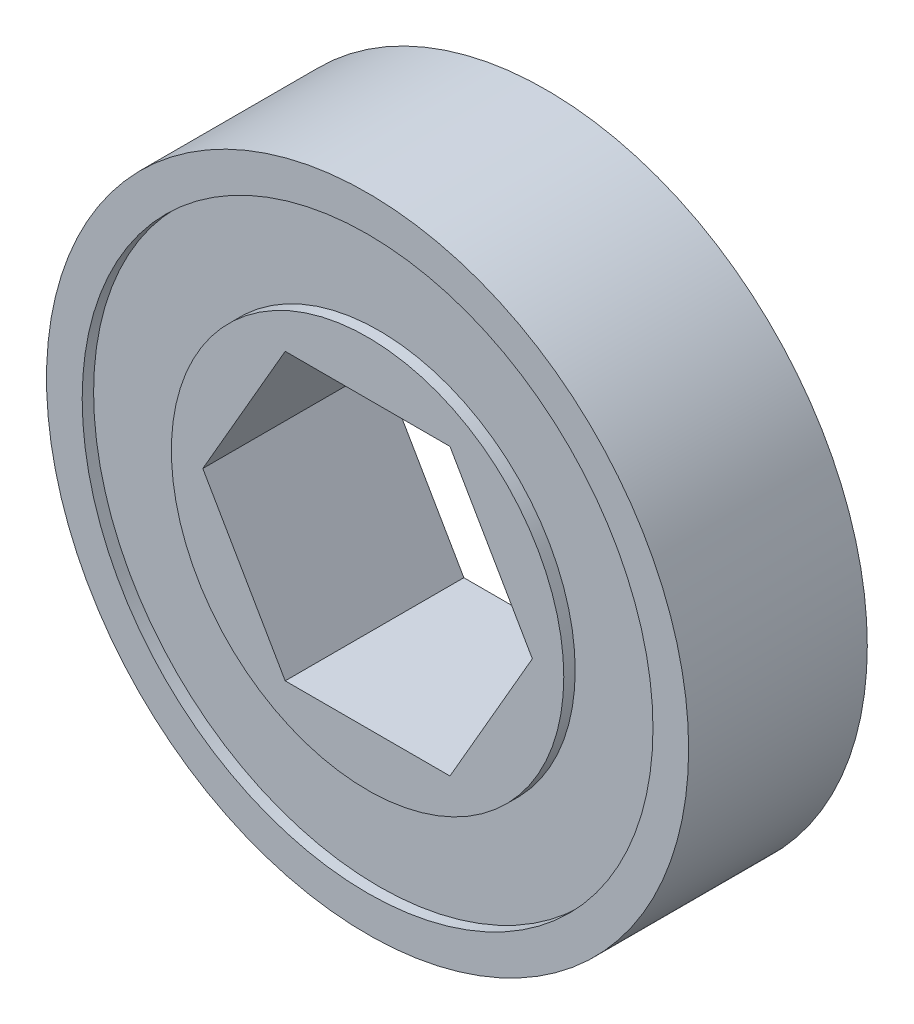
ISO-10303-21;
HEADER;
FILE_DESCRIPTION(('STEP AP214'),'2;1');
FILE_NAME('part.step','',(''),(''),'','','');
FILE_SCHEMA(('AUTOMOTIVE_DESIGN { 1 0 10303 214 1 1 1 1 }'));
ENDSEC;
DATA;
#1=APPLICATION_CONTEXT('core data for automotive mechanical design processes');
#2=APPLICATION_PROTOCOL_DEFINITION('international standard','automotive_design',2000,#1);
#3=PRODUCT_CONTEXT('',#1,'mechanical');
#4=PRODUCT('Part','Part','',(#3));
#5=PRODUCT_RELATED_PRODUCT_CATEGORY('part','',(#4));
#6=PRODUCT_DEFINITION_FORMATION('','',#4);
#7=PRODUCT_DEFINITION_CONTEXT('part definition',#1,'design');
#8=PRODUCT_DEFINITION('design','',#6,#7);
#9=PRODUCT_DEFINITION_SHAPE('','',#8);
#10=(LENGTH_UNIT() NAMED_UNIT(*) SI_UNIT(.MILLI.,.METRE.));
#11=(NAMED_UNIT(*) PLANE_ANGLE_UNIT() SI_UNIT($,.RADIAN.));
#12=(NAMED_UNIT(*) SI_UNIT($,.STERADIAN.) SOLID_ANGLE_UNIT());
#13=UNCERTAINTY_MEASURE_WITH_UNIT(LENGTH_MEASURE(1.E-05),#10,'distance_accuracy_value','');
#14=(GEOMETRIC_REPRESENTATION_CONTEXT(3) GLOBAL_UNCERTAINTY_ASSIGNED_CONTEXT((#13)) GLOBAL_UNIT_ASSIGNED_CONTEXT((#10,
#11,#12)) REPRESENTATION_CONTEXT('',''));
#15=CARTESIAN_POINT('',(0.,0.,0.));
#16=DIRECTION('',(0.,0.,1.));
#17=DIRECTION('',(1.,0.,0.));
#18=AXIS2_PLACEMENT_3D('',#15,#16,#17);
#19=CARTESIAN_POINT('',(0.,0.,-3.9751));
#20=DIRECTION('',(0.,0.,1.));
#21=DIRECTION('',(1.,0.,0.));
#22=AXIS2_PLACEMENT_3D('',#19,#20,#21);
#23=PLANE('',#22);
#24=DIRECTION('',(0.5,0.866025403784439,0.));
#25=VECTOR('',#24,1.);
#26=CARTESIAN_POINT('',(3.66617420935412,-6.35,-3.9751));
#27=LINE('',#26,#25);
#28=CARTESIAN_POINT('',(3.66617420935412,-6.35,-3.9751));
#29=VERTEX_POINT('',#28);
#30=CARTESIAN_POINT('',(7.33234841870825,0.,-3.9751));
#31=VERTEX_POINT('',#30);
#32=EDGE_CURVE('E58',#29,#31,#27,.T.);
#33=ORIENTED_EDGE('',*,*,#32,.T.);
#34=DIRECTION('',(-0.5,0.866025403784438,0.));
#35=VECTOR('',#34,1.);
#36=CARTESIAN_POINT('',(7.33234841870825,0.,-3.9751));
#37=LINE('',#36,#35);
#38=CARTESIAN_POINT('',(3.66617420935412,6.35,-3.9751));
#39=VERTEX_POINT('',#38);
#40=EDGE_CURVE('E103',#31,#39,#37,.T.);
#41=ORIENTED_EDGE('',*,*,#40,.T.);
#42=DIRECTION('',(-1.,0.,0.));
#43=VECTOR('',#42,1.);
#44=CARTESIAN_POINT('',(3.66617420935412,6.35,-3.9751));
#45=LINE('',#44,#43);
#46=CARTESIAN_POINT('',(-3.66617420935412,6.35,-3.9751));
#47=VERTEX_POINT('',#46);
#48=EDGE_CURVE('E124',#39,#47,#45,.T.);
#49=ORIENTED_EDGE('',*,*,#48,.T.);
#50=DIRECTION('',(-0.5,-0.866025403784439,0.));
#51=VECTOR('',#50,1.);
#52=CARTESIAN_POINT('',(-3.66617420935412,6.35,-3.9751));
#53=LINE('',#52,#51);
#54=CARTESIAN_POINT('',(-7.33234841870825,0.,-3.9751));
#55=VERTEX_POINT('',#54);
#56=EDGE_CURVE('E127',#47,#55,#53,.T.);
#57=ORIENTED_EDGE('',*,*,#56,.T.);
#58=DIRECTION('',(0.5,-0.866025403784439,0.));
#59=VECTOR('',#58,1.);
#60=CARTESIAN_POINT('',(-7.33234841870825,0.,-3.9751));
#61=LINE('',#60,#59);
#62=CARTESIAN_POINT('',(-3.66617420935412,-6.35,-3.9751));
#63=VERTEX_POINT('',#62);
#64=EDGE_CURVE('E130',#55,#63,#61,.T.);
#65=ORIENTED_EDGE('',*,*,#64,.T.);
#66=DIRECTION('',(1.,0.,0.));
#67=VECTOR('',#66,1.);
#68=CARTESIAN_POINT('',(-3.66617420935412,-6.35,-3.9751));
#69=LINE('',#68,#67);
#70=EDGE_CURVE('E97',#63,#29,#69,.T.);
#71=ORIENTED_EDGE('',*,*,#70,.T.);
#72=EDGE_LOOP('',(#33,#41,#49,#57,#65,#71));
#73=FACE_BOUND('',#72,.T.);
#74=CARTESIAN_POINT('',(0.,0.,-3.9751));
#75=DIRECTION('',(0.,0.,1.));
#76=DIRECTION('',(1.,0.,0.));
#77=AXIS2_PLACEMENT_3D('',#74,#75,#76);
#78=CIRCLE('',#77,8.73125);
#79=CARTESIAN_POINT('',(8.73125,0.,-3.9751));
#80=VERTEX_POINT('',#79);
#81=EDGE_CURVE('E194',#80,#80,#78,.T.);
#82=ORIENTED_EDGE('',*,*,#81,.F.);
#83=EDGE_LOOP('',(#82));
#84=FACE_BOUND('',#83,.T.);
#85=ADVANCED_FACE('F35',(#73,#84),#23,.F.);
#86=CARTESIAN_POINT('',(0.,0.,3.9751));
#87=DIRECTION('',(0.,0.,1.));
#88=DIRECTION('',(1.,0.,0.));
#89=AXIS2_PLACEMENT_3D('',#86,#87,#88);
#90=PLANE('',#89);
#91=DIRECTION('',(-0.5,0.866025403784438,0.));
#92=VECTOR('',#91,1.);
#93=CARTESIAN_POINT('',(7.33234841870825,0.,3.9751));
#94=LINE('',#93,#92);
#95=CARTESIAN_POINT('',(7.33234841870825,0.,3.9751));
#96=VERTEX_POINT('',#95);
#97=CARTESIAN_POINT('',(3.66617420935412,6.35,3.9751));
#98=VERTEX_POINT('',#97);
#99=EDGE_CURVE('E96',#96,#98,#94,.T.);
#100=ORIENTED_EDGE('',*,*,#99,.F.);
#101=DIRECTION('',(0.5,0.866025403784439,0.));
#102=VECTOR('',#101,1.);
#103=CARTESIAN_POINT('',(3.66617420935412,-6.35,3.9751));
#104=LINE('',#103,#102);
#105=CARTESIAN_POINT('',(3.66617420935412,-6.35,3.9751));
#106=VERTEX_POINT('',#105);
#107=EDGE_CURVE('E88',#106,#96,#104,.T.);
#108=ORIENTED_EDGE('',*,*,#107,.F.);
#109=DIRECTION('',(1.,0.,0.));
#110=VECTOR('',#109,1.);
#111=CARTESIAN_POINT('',(-3.66617420935412,-6.35,3.9751));
#112=LINE('',#111,#110);
#113=CARTESIAN_POINT('',(-3.66617420935412,-6.35,3.9751));
#114=VERTEX_POINT('',#113);
#115=EDGE_CURVE('E119',#114,#106,#112,.T.);
#116=ORIENTED_EDGE('',*,*,#115,.F.);
#117=DIRECTION('',(0.5,-0.866025403784439,0.));
#118=VECTOR('',#117,1.);
#119=CARTESIAN_POINT('',(-7.33234841870825,0.,3.9751));
#120=LINE('',#119,#118);
#121=CARTESIAN_POINT('',(-7.33234841870825,0.,3.9751));
#122=VERTEX_POINT('',#121);
#123=EDGE_CURVE('E117',#122,#114,#120,.T.);
#124=ORIENTED_EDGE('',*,*,#123,.F.);
#125=DIRECTION('',(-0.5,-0.866025403784439,0.));
#126=VECTOR('',#125,1.);
#127=CARTESIAN_POINT('',(-3.66617420935412,6.35,3.9751));
#128=LINE('',#127,#126);
#129=CARTESIAN_POINT('',(-3.66617420935412,6.35,3.9751));
#130=VERTEX_POINT('',#129);
#131=EDGE_CURVE('E112',#130,#122,#128,.T.);
#132=ORIENTED_EDGE('',*,*,#131,.F.);
#133=DIRECTION('',(-1.,0.,0.));
#134=VECTOR('',#133,1.);
#135=CARTESIAN_POINT('',(3.66617420935412,6.35,3.9751));
#136=LINE('',#135,#134);
#137=EDGE_CURVE('E110',#98,#130,#136,.T.);
#138=ORIENTED_EDGE('',*,*,#137,.F.);
#139=EDGE_LOOP('',(#100,#108,#116,#124,#132,#138));
#140=FACE_BOUND('',#139,.T.);
#141=CARTESIAN_POINT('',(0.,0.,3.9751));
#142=DIRECTION('',(0.,0.,1.));
#143=DIRECTION('',(1.,0.,0.));
#144=AXIS2_PLACEMENT_3D('',#141,#142,#143);
#145=CIRCLE('',#144,8.73125);
#146=CARTESIAN_POINT('',(8.73125,0.,3.9751));
#147=VERTEX_POINT('',#146);
#148=EDGE_CURVE('E191',#147,#147,#145,.T.);
#149=ORIENTED_EDGE('',*,*,#148,.T.);
#150=EDGE_LOOP('',(#149));
#151=FACE_BOUND('',#150,.T.);
#152=ADVANCED_FACE('F107',(#140,#151),#90,.T.);
#153=CARTESIAN_POINT('',(0.,0.,3.9751));
#154=DIRECTION('',(0.,0.,1.));
#155=DIRECTION('',(1.,0.,0.));
#156=AXIS2_PLACEMENT_3D('',#153,#154,#155);
#157=CIRCLE('',#156,12.7);
#158=CARTESIAN_POINT('',(12.7,0.,3.9751));
#159=VERTEX_POINT('',#158);
#160=EDGE_CURVE('E201',#159,#159,#157,.T.);
#161=ORIENTED_EDGE('',*,*,#160,.F.);
#162=EDGE_LOOP('',(#161));
#163=FACE_BOUND('',#162,.T.);
#164=CARTESIAN_POINT('',(0.,0.,3.9751));
#165=DIRECTION('',(0.,0.,1.));
#166=DIRECTION('',(1.,0.,0.));
#167=AXIS2_PLACEMENT_3D('',#164,#165,#166);
#168=CIRCLE('',#167,14.2875);
#169=CARTESIAN_POINT('',(14.2875,0.,3.9751));
#170=VERTEX_POINT('',#169);
#171=EDGE_CURVE('E11',#170,#170,#168,.T.);
#172=ORIENTED_EDGE('',*,*,#171,.T.);
#173=EDGE_LOOP('',(#172));
#174=FACE_BOUND('',#173,.T.);
#175=ADVANCED_FACE('F169',(#163,#174),#90,.T.);
#176=CARTESIAN_POINT('',(0.,0.,-3.9751));
#177=DIRECTION('',(0.,0.,1.));
#178=DIRECTION('',(1.,0.,0.));
#179=AXIS2_PLACEMENT_3D('',#176,#177,#178);
#180=CIRCLE('',#179,12.7);
#181=CARTESIAN_POINT('',(12.7,0.,-3.9751));
#182=VERTEX_POINT('',#181);
#183=EDGE_CURVE('E182',#182,#182,#180,.T.);
#184=ORIENTED_EDGE('',*,*,#183,.T.);
#185=EDGE_LOOP('',(#184));
#186=FACE_BOUND('',#185,.T.);
#187=CARTESIAN_POINT('',(0.,0.,-3.9751));
#188=DIRECTION('',(0.,0.,1.));
#189=DIRECTION('',(1.,0.,0.));
#190=AXIS2_PLACEMENT_3D('',#187,#188,#189);
#191=CIRCLE('',#190,14.2875);
#192=CARTESIAN_POINT('',(14.2875,0.,-3.9751));
#193=VERTEX_POINT('',#192);
#194=EDGE_CURVE('E39',#193,#193,#191,.T.);
#195=ORIENTED_EDGE('',*,*,#194,.F.);
#196=EDGE_LOOP('',(#195));
#197=FACE_BOUND('',#196,.T.);
#198=ADVANCED_FACE('F165',(#186,#197),#23,.F.);
#199=CARTESIAN_POINT('',(0.,0.,3.9751));
#200=DIRECTION('',(0.,0.,-1.));
#201=DIRECTION('',(-1.,0.,0.));
#202=AXIS2_PLACEMENT_3D('',#199,#200,#201);
#203=CYLINDRICAL_SURFACE('',#202,14.2875);
#204=ORIENTED_EDGE('',*,*,#171,.F.);
#205=EDGE_LOOP('',(#204));
#206=FACE_BOUND('',#205,.T.);
#207=ORIENTED_EDGE('',*,*,#194,.T.);
#208=EDGE_LOOP('',(#207));
#209=FACE_BOUND('',#208,.T.);
#210=ADVANCED_FACE('F37',(#206,#209),#203,.T.);
#211=CARTESIAN_POINT('',(3.66617420935412,-6.35,3.9751));
#212=DIRECTION('',(-0.866025403784439,0.5,0.));
#213=DIRECTION('',(-0.5,-0.866025403784439,0.));
#214=AXIS2_PLACEMENT_3D('',#211,#212,#213);
#215=PLANE('',#214);
#216=ORIENTED_EDGE('',*,*,#32,.F.);
#217=DIRECTION('',(0.,0.,-1.));
#218=VECTOR('',#217,1.);
#219=CARTESIAN_POINT('',(3.66617420935412,-6.35,3.9751));
#220=LINE('',#219,#218);
#221=EDGE_CURVE('E92',#106,#29,#220,.T.);
#222=ORIENTED_EDGE('',*,*,#221,.F.);
#223=ORIENTED_EDGE('',*,*,#107,.T.);
#224=DIRECTION('',(0.,0.,-1.));
#225=VECTOR('',#224,1.);
#226=CARTESIAN_POINT('',(7.33234841870825,0.,3.9751));
#227=LINE('',#226,#225);
#228=EDGE_CURVE('E91',#96,#31,#227,.T.);
#229=ORIENTED_EDGE('',*,*,#228,.T.);
#230=EDGE_LOOP('',(#216,#222,#223,#229));
#231=FACE_BOUND('',#230,.T.);
#232=ADVANCED_FACE('F90',(#231),#215,.T.);
#233=CARTESIAN_POINT('',(7.33234841870825,0.,3.9751));
#234=DIRECTION('',(-0.866025403784439,-0.5,0.));
#235=DIRECTION('',(0.5,-0.866025403784439,0.));
#236=AXIS2_PLACEMENT_3D('',#233,#234,#235);
#237=PLANE('',#236);
#238=ORIENTED_EDGE('',*,*,#40,.F.);
#239=ORIENTED_EDGE('',*,*,#228,.F.);
#240=ORIENTED_EDGE('',*,*,#99,.T.);
#241=DIRECTION('',(0.,0.,-1.));
#242=VECTOR('',#241,1.);
#243=CARTESIAN_POINT('',(3.66617420935412,6.35,3.9751));
#244=LINE('',#243,#242);
#245=EDGE_CURVE('E104',#98,#39,#244,.T.);
#246=ORIENTED_EDGE('',*,*,#245,.T.);
#247=EDGE_LOOP('',(#238,#239,#240,#246));
#248=FACE_BOUND('',#247,.T.);
#249=ADVANCED_FACE('F100',(#248),#237,.T.);
#250=CARTESIAN_POINT('',(3.66617420935412,6.35,3.9751));
#251=DIRECTION('',(0.,-1.,0.));
#252=DIRECTION('',(0.,0.,-1.));
#253=AXIS2_PLACEMENT_3D('',#250,#251,#252);
#254=PLANE('',#253);
#255=ORIENTED_EDGE('',*,*,#48,.F.);
#256=ORIENTED_EDGE('',*,*,#245,.F.);
#257=ORIENTED_EDGE('',*,*,#137,.T.);
#258=DIRECTION('',(0.,0.,-1.));
#259=VECTOR('',#258,1.);
#260=CARTESIAN_POINT('',(-3.66617420935412,6.35,3.9751));
#261=LINE('',#260,#259);
#262=EDGE_CURVE('E139',#130,#47,#261,.T.);
#263=ORIENTED_EDGE('',*,*,#262,.T.);
#264=EDGE_LOOP('',(#255,#256,#257,#263));
#265=FACE_BOUND('',#264,.T.);
#266=ADVANCED_FACE('F143',(#265),#254,.T.);
#267=CARTESIAN_POINT('',(-3.66617420935412,6.35,3.9751));
#268=DIRECTION('',(0.866025403784439,-0.5,0.));
#269=DIRECTION('',(0.5,0.866025403784439,0.));
#270=AXIS2_PLACEMENT_3D('',#267,#268,#269);
#271=PLANE('',#270);
#272=ORIENTED_EDGE('',*,*,#56,.F.);
#273=ORIENTED_EDGE('',*,*,#262,.F.);
#274=ORIENTED_EDGE('',*,*,#131,.T.);
#275=DIRECTION('',(0.,0.,-1.));
#276=VECTOR('',#275,1.);
#277=CARTESIAN_POINT('',(-7.33234841870825,0.,3.9751));
#278=LINE('',#277,#276);
#279=EDGE_CURVE('E137',#122,#55,#278,.T.);
#280=ORIENTED_EDGE('',*,*,#279,.T.);
#281=EDGE_LOOP('',(#272,#273,#274,#280));
#282=FACE_BOUND('',#281,.T.);
#283=ADVANCED_FACE('F155',(#282),#271,.T.);
#284=CARTESIAN_POINT('',(-7.33234841870825,0.,3.9751));
#285=DIRECTION('',(0.866025403784439,0.5,0.));
#286=DIRECTION('',(-0.5,0.866025403784439,0.));
#287=AXIS2_PLACEMENT_3D('',#284,#285,#286);
#288=PLANE('',#287);
#289=ORIENTED_EDGE('',*,*,#64,.F.);
#290=ORIENTED_EDGE('',*,*,#279,.F.);
#291=ORIENTED_EDGE('',*,*,#123,.T.);
#292=DIRECTION('',(0.,0.,-1.));
#293=VECTOR('',#292,1.);
#294=CARTESIAN_POINT('',(-3.66617420935412,-6.35,3.9751));
#295=LINE('',#294,#293);
#296=EDGE_CURVE('E50',#114,#63,#295,.T.);
#297=ORIENTED_EDGE('',*,*,#296,.T.);
#298=EDGE_LOOP('',(#289,#290,#291,#297));
#299=FACE_BOUND('',#298,.T.);
#300=ADVANCED_FACE('F153',(#299),#288,.T.);
#301=CARTESIAN_POINT('',(-3.66617420935412,-6.35,3.9751));
#302=DIRECTION('',(0.,1.,0.));
#303=DIRECTION('',(-1.,0.,0.));
#304=AXIS2_PLACEMENT_3D('',#301,#302,#303);
#305=PLANE('',#304);
#306=ORIENTED_EDGE('',*,*,#70,.F.);
#307=ORIENTED_EDGE('',*,*,#296,.F.);
#308=ORIENTED_EDGE('',*,*,#115,.T.);
#309=ORIENTED_EDGE('',*,*,#221,.T.);
#310=EDGE_LOOP('',(#306,#307,#308,#309));
#311=FACE_BOUND('',#310,.T.);
#312=ADVANCED_FACE('F149',(#311),#305,.T.);
#313=CARTESIAN_POINT('',(0.,0.,3.4671));
#314=DIRECTION('',(0.,0.,1.));
#315=DIRECTION('',(1.,0.,0.));
#316=AXIS2_PLACEMENT_3D('',#313,#314,#315);
#317=CYLINDRICAL_SURFACE('',#316,12.7);
#318=CARTESIAN_POINT('',(0.,0.,3.4671));
#319=DIRECTION('',(0.,0.,1.));
#320=DIRECTION('',(1.,0.,0.));
#321=AXIS2_PLACEMENT_3D('',#318,#319,#320);
#322=CIRCLE('',#321,12.7);
#323=CARTESIAN_POINT('',(12.7,0.,3.4671));
#324=VERTEX_POINT('',#323);
#325=EDGE_CURVE('E122',#324,#324,#322,.T.);
#326=ORIENTED_EDGE('',*,*,#325,.F.);
#327=EDGE_LOOP('',(#326));
#328=FACE_BOUND('',#327,.T.);
#329=ORIENTED_EDGE('',*,*,#160,.T.);
#330=EDGE_LOOP('',(#329));
#331=FACE_BOUND('',#330,.T.);
#332=ADVANCED_FACE('F208',(#328,#331),#317,.F.);
#333=CARTESIAN_POINT('',(0.,0.,3.4671));
#334=DIRECTION('',(0.,0.,1.));
#335=DIRECTION('',(1.,0.,0.));
#336=AXIS2_PLACEMENT_3D('',#333,#334,#335);
#337=PLANE('',#336);
#338=CARTESIAN_POINT('',(0.,0.,3.4671));
#339=DIRECTION('',(0.,0.,1.));
#340=DIRECTION('',(1.,0.,0.));
#341=AXIS2_PLACEMENT_3D('',#338,#339,#340);
#342=CIRCLE('',#341,8.73125);
#343=CARTESIAN_POINT('',(8.73125,0.,3.4671));
#344=VERTEX_POINT('',#343);
#345=EDGE_CURVE('E198',#344,#344,#342,.T.);
#346=ORIENTED_EDGE('',*,*,#345,.F.);
#347=EDGE_LOOP('',(#346));
#348=FACE_BOUND('',#347,.T.);
#349=ORIENTED_EDGE('',*,*,#325,.T.);
#350=EDGE_LOOP('',(#349));
#351=FACE_BOUND('',#350,.T.);
#352=ADVANCED_FACE('F212',(#348,#351),#337,.T.);
#353=CARTESIAN_POINT('',(0.,0.,3.4671));
#354=DIRECTION('',(0.,0.,1.));
#355=DIRECTION('',(1.,0.,0.));
#356=AXIS2_PLACEMENT_3D('',#353,#354,#355);
#357=CYLINDRICAL_SURFACE('',#356,8.73125);
#358=ORIENTED_EDGE('',*,*,#345,.T.);
#359=EDGE_LOOP('',(#358));
#360=FACE_BOUND('',#359,.T.);
#361=ORIENTED_EDGE('',*,*,#148,.F.);
#362=EDGE_LOOP('',(#361));
#363=FACE_BOUND('',#362,.T.);
#364=ADVANCED_FACE('F219',(#360,#363),#357,.T.);
#365=CARTESIAN_POINT('',(0.,0.,-3.4671));
#366=DIRECTION('',(0.,0.,-1.));
#367=DIRECTION('',(1.,0.,0.));
#368=AXIS2_PLACEMENT_3D('',#365,#366,#367);
#369=PLANE('',#368);
#370=CARTESIAN_POINT('',(0.,0.,-3.4671));
#371=DIRECTION('',(0.,0.,1.));
#372=DIRECTION('',(1.,0.,0.));
#373=AXIS2_PLACEMENT_3D('',#370,#371,#372);
#374=CIRCLE('',#373,12.7);
#375=CARTESIAN_POINT('',(12.7,0.,-3.4671));
#376=VERTEX_POINT('',#375);
#377=EDGE_CURVE('E187',#376,#376,#374,.T.);
#378=ORIENTED_EDGE('',*,*,#377,.F.);
#379=EDGE_LOOP('',(#378));
#380=FACE_BOUND('',#379,.T.);
#381=CARTESIAN_POINT('',(0.,0.,-3.4671));
#382=DIRECTION('',(0.,0.,1.));
#383=DIRECTION('',(1.,0.,0.));
#384=AXIS2_PLACEMENT_3D('',#381,#382,#383);
#385=CIRCLE('',#384,8.73125);
#386=CARTESIAN_POINT('',(8.73125,0.,-3.4671));
#387=VERTEX_POINT('',#386);
#388=EDGE_CURVE('E188',#387,#387,#385,.T.);
#389=ORIENTED_EDGE('',*,*,#388,.T.);
#390=EDGE_LOOP('',(#389));
#391=FACE_BOUND('',#390,.T.);
#392=ADVANCED_FACE('F227',(#380,#391),#369,.T.);
#393=CARTESIAN_POINT('',(0.,0.,-3.4671));
#394=DIRECTION('',(0.,0.,-1.));
#395=DIRECTION('',(-1.,0.,0.));
#396=AXIS2_PLACEMENT_3D('',#393,#394,#395);
#397=CYLINDRICAL_SURFACE('',#396,12.7);
#398=ORIENTED_EDGE('',*,*,#377,.T.);
#399=EDGE_LOOP('',(#398));
#400=FACE_BOUND('',#399,.T.);
#401=ORIENTED_EDGE('',*,*,#183,.F.);
#402=EDGE_LOOP('',(#401));
#403=FACE_BOUND('',#402,.T.);
#404=ADVANCED_FACE('F229',(#400,#403),#397,.F.);
#405=CARTESIAN_POINT('',(0.,0.,-3.4671));
#406=DIRECTION('',(0.,0.,-1.));
#407=DIRECTION('',(-1.,0.,0.));
#408=AXIS2_PLACEMENT_3D('',#405,#406,#407);
#409=CYLINDRICAL_SURFACE('',#408,8.73125);
#410=ORIENTED_EDGE('',*,*,#388,.F.);
#411=EDGE_LOOP('',(#410));
#412=FACE_BOUND('',#411,.T.);
#413=ORIENTED_EDGE('',*,*,#81,.T.);
#414=EDGE_LOOP('',(#413));
#415=FACE_BOUND('',#414,.T.);
#416=ADVANCED_FACE('F232',(#412,#415),#409,.T.);
#417=CLOSED_SHELL('',(#85,#152,#175,#198,#210,#232,#249,#266,#283,#300,#312,#332,#352,#364,#392,
#404,#416));
#418=MANIFOLD_SOLID_BREP('B2',#417);
#419=ADVANCED_BREP_SHAPE_REPRESENTATION('',(#18,#418),#14);
#420=SHAPE_DEFINITION_REPRESENTATION(#9,#419);
ENDSEC;
END-ISO-10303-21;
